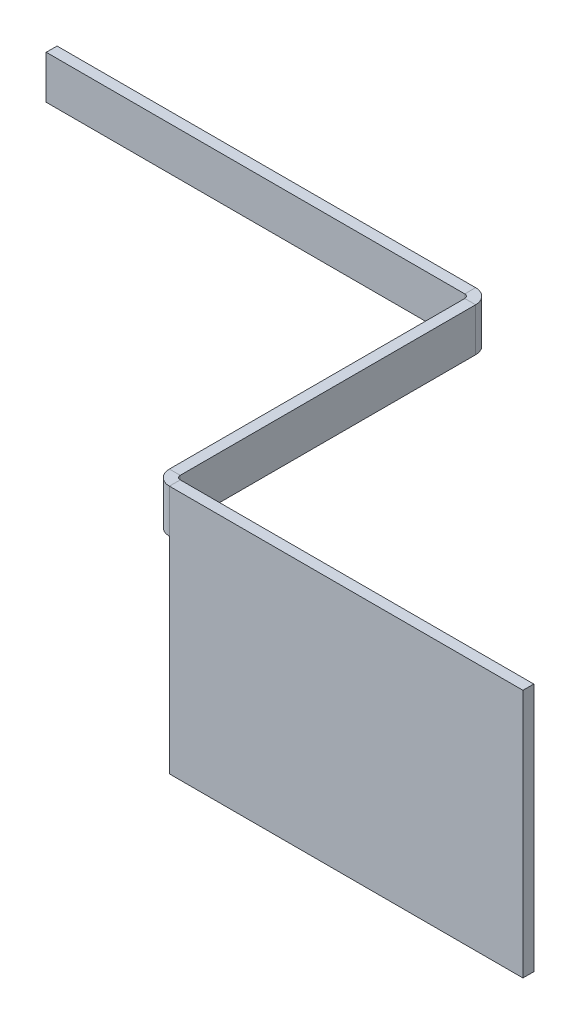
ISO-10303-21;
HEADER;
FILE_DESCRIPTION(('STEP AP214'),'2;1');
FILE_NAME('part.step','',(''),(''),'','','');
FILE_SCHEMA(('AUTOMOTIVE_DESIGN { 1 0 10303 214 1 1 1 1 }'));
ENDSEC;
DATA;
#1=APPLICATION_CONTEXT('core data for automotive mechanical design processes');
#2=APPLICATION_PROTOCOL_DEFINITION('international standard','automotive_design',2000,#1);
#3=PRODUCT_CONTEXT('',#1,'mechanical');
#4=PRODUCT('Part','Part','',(#3));
#5=PRODUCT_RELATED_PRODUCT_CATEGORY('part','',(#4));
#6=PRODUCT_DEFINITION_FORMATION('','',#4);
#7=PRODUCT_DEFINITION_CONTEXT('part definition',#1,'design');
#8=PRODUCT_DEFINITION('design','',#6,#7);
#9=PRODUCT_DEFINITION_SHAPE('','',#8);
#10=(LENGTH_UNIT() NAMED_UNIT(*) SI_UNIT(.MILLI.,.METRE.));
#11=(NAMED_UNIT(*) PLANE_ANGLE_UNIT() SI_UNIT($,.RADIAN.));
#12=(NAMED_UNIT(*) SI_UNIT($,.STERADIAN.) SOLID_ANGLE_UNIT());
#13=UNCERTAINTY_MEASURE_WITH_UNIT(LENGTH_MEASURE(1.E-05),#10,'distance_accuracy_value','');
#14=(GEOMETRIC_REPRESENTATION_CONTEXT(3) GLOBAL_UNCERTAINTY_ASSIGNED_CONTEXT((#13)) GLOBAL_UNIT_ASSIGNED_CONTEXT((#10,
#11,#12)) REPRESENTATION_CONTEXT('',''));
#15=CARTESIAN_POINT('',(0.,0.,0.));
#16=DIRECTION('',(0.,0.,1.));
#17=DIRECTION('',(1.,0.,0.));
#18=AXIS2_PLACEMENT_3D('',#15,#16,#17);
#19=CARTESIAN_POINT('',(-193.503570939661,-85.1225213772165,392.500000000001));
#20=DIRECTION('',(0.,-1.,0.));
#21=DIRECTION('',(0.,0.,-1.));
#22=AXIS2_PLACEMENT_3D('',#19,#20,#21);
#23=PLANE('',#22);
#24=DIRECTION('',(1.,0.,0.));
#25=VECTOR('',#24,1.);
#26=CARTESIAN_POINT('',(-193.503570939661,-85.1225213772165,395.236600000001));
#27=LINE('',#26,#25);
#28=CARTESIAN_POINT('',(-193.503570939661,-85.1225213772165,395.236600000001));
#29=VERTEX_POINT('',#28);
#30=CARTESIAN_POINT('',(-191.503570939661,-85.1225213772165,395.236600000001));
#31=VERTEX_POINT('',#30);
#32=EDGE_CURVE('E267',#29,#31,#27,.T.);
#33=ORIENTED_EDGE('',*,*,#32,.F.);
#34=DIRECTION('',(0.,0.,-1.));
#35=VECTOR('',#34,1.);
#36=CARTESIAN_POINT('',(-193.503570939662,-85.1225213772166,8.88178419700125E-13));
#37=LINE('',#36,#35);
#38=CARTESIAN_POINT('',(-193.503570939661,-85.1225213772165,449.763400000001));
#39=VERTEX_POINT('',#38);
#40=EDGE_CURVE('E99',#39,#29,#37,.T.);
#41=ORIENTED_EDGE('',*,*,#40,.F.);
#42=DIRECTION('',(-1.,0.,0.));
#43=VECTOR('',#42,1.);
#44=CARTESIAN_POINT('',(-191.503570939661,-85.1225213772165,449.763400000001));
#45=LINE('',#44,#43);
#46=CARTESIAN_POINT('',(-191.503570939661,-85.1225213772165,449.7634));
#47=VERTEX_POINT('',#46);
#48=EDGE_CURVE('E272',#47,#39,#45,.T.);
#49=ORIENTED_EDGE('',*,*,#48,.F.);
#50=DIRECTION('',(0.,0.,1.));
#51=VECTOR('',#50,1.);
#52=CARTESIAN_POINT('',(-191.503570939661,-85.1225213772165,392.500000000001));
#53=LINE('',#52,#51);
#54=EDGE_CURVE('E256',#47,#31,#53,.F.);
#55=ORIENTED_EDGE('',*,*,#54,.T.);
#56=EDGE_LOOP('',(#33,#41,#49,#55));
#57=FACE_BOUND('',#56,.T.);
#58=ADVANCED_FACE('F75',(#57),#23,.F.);
#59=CARTESIAN_POINT('',(-193.503570939662,0.,8.88178419700125E-13));
#60=DIRECTION('',(1.,0.,0.));
#61=DIRECTION('',(0.,0.,-1.));
#62=AXIS2_PLACEMENT_3D('',#59,#60,#61);
#63=PLANE('',#62);
#64=DIRECTION('',(0.,1.,0.));
#65=VECTOR('',#64,1.);
#66=CARTESIAN_POINT('',(-193.503570939661,-131.122521377217,395.236600000001));
#67=LINE('',#66,#65);
#68=CARTESIAN_POINT('',(-193.503570939661,-93.1225213772165,395.236600000001));
#69=VERTEX_POINT('',#68);
#70=EDGE_CURVE('E264',#69,#29,#67,.T.);
#71=ORIENTED_EDGE('',*,*,#70,.F.);
#72=DIRECTION('',(0.,0.,-1.));
#73=VECTOR('',#72,1.);
#74=CARTESIAN_POINT('',(-193.503570939661,-93.1225213772165,452.491244901112));
#75=LINE('',#74,#73);
#76=CARTESIAN_POINT('',(-193.503570939661,-93.1225213772165,449.7634));
#77=VERTEX_POINT('',#76);
#78=EDGE_CURVE('E79',#77,#69,#75,.T.);
#79=ORIENTED_EDGE('',*,*,#78,.F.);
#80=DIRECTION('',(0.,-1.,0.));
#81=VECTOR('',#80,1.);
#82=CARTESIAN_POINT('',(-193.503570939661,-131.122521377216,449.763400000001));
#83=LINE('',#82,#81);
#84=EDGE_CURVE('E84',#39,#77,#83,.T.);
#85=ORIENTED_EDGE('',*,*,#84,.F.);
#86=ORIENTED_EDGE('',*,*,#40,.T.);
#87=EDGE_LOOP('',(#71,#79,#85,#86));
#88=FACE_BOUND('',#87,.T.);
#89=ADVANCED_FACE('F280',(#88),#63,.F.);
#90=CARTESIAN_POINT('',(-191.503570939662,0.,8.88178419700125E-13));
#91=DIRECTION('',(1.,0.,0.));
#92=DIRECTION('',(0.,0.,-1.));
#93=AXIS2_PLACEMENT_3D('',#90,#91,#92);
#94=PLANE('',#93);
#95=DIRECTION('',(0.,0.,1.));
#96=VECTOR('',#95,1.);
#97=CARTESIAN_POINT('',(-191.503570939661,-93.1225213772165,452.491244901112));
#98=LINE('',#97,#96);
#99=CARTESIAN_POINT('',(-191.503570939661,-93.1225213772165,395.236600000001));
#100=VERTEX_POINT('',#99);
#101=CARTESIAN_POINT('',(-191.503570939661,-93.1225213772165,449.7634));
#102=VERTEX_POINT('',#101);
#103=EDGE_CURVE('E258',#100,#102,#98,.T.);
#104=ORIENTED_EDGE('',*,*,#103,.F.);
#105=DIRECTION('',(0.,1.,0.));
#106=VECTOR('',#105,1.);
#107=CARTESIAN_POINT('',(-191.503570939661,-131.122521377217,395.236600000001));
#108=LINE('',#107,#106);
#109=EDGE_CURVE('E255',#100,#31,#108,.T.);
#110=ORIENTED_EDGE('',*,*,#109,.T.);
#111=ORIENTED_EDGE('',*,*,#54,.F.);
#112=DIRECTION('',(0.,1.,0.));
#113=VECTOR('',#112,1.);
#114=CARTESIAN_POINT('',(-191.503570939661,-131.122521377216,449.763400000001));
#115=LINE('',#114,#113);
#116=EDGE_CURVE('E270',#102,#47,#115,.T.);
#117=ORIENTED_EDGE('',*,*,#116,.F.);
#118=EDGE_LOOP('',(#104,#110,#111,#117));
#119=FACE_BOUND('',#118,.T.);
#120=ADVANCED_FACE('F311',(#119),#94,.T.);
#121=CARTESIAN_POINT('',(-49.0941812646674,-93.1225213772165,452.491244901113));
#122=DIRECTION('',(0.,1.,0.));
#123=DIRECTION('',(0.,0.,-1.));
#124=AXIS2_PLACEMENT_3D('',#121,#122,#123);
#125=PLANE('',#124);
#126=DIRECTION('',(1.,0.,0.));
#127=VECTOR('',#126,1.);
#128=CARTESIAN_POINT('',(-193.503570939661,-93.1225213772165,449.7634));
#129=LINE('',#128,#127);
#130=EDGE_CURVE('E13',#77,#102,#129,.T.);
#131=ORIENTED_EDGE('',*,*,#130,.F.);
#132=ORIENTED_EDGE('',*,*,#78,.T.);
#133=DIRECTION('',(-1.,0.,0.));
#134=VECTOR('',#133,1.);
#135=CARTESIAN_POINT('',(-191.503570939661,-93.1225213772165,395.236600000001));
#136=LINE('',#135,#134);
#137=EDGE_CURVE('E261',#100,#69,#136,.T.);
#138=ORIENTED_EDGE('',*,*,#137,.F.);
#139=ORIENTED_EDGE('',*,*,#103,.T.);
#140=EDGE_LOOP('',(#131,#132,#138,#139));
#141=FACE_BOUND('',#140,.T.);
#142=ADVANCED_FACE('F77',(#141),#125,.F.);
#143=CARTESIAN_POINT('',(-194.240170939661,-93.1225213772165,395.236600000001));
#144=DIRECTION('',(0.,-1.,0.));
#145=DIRECTION('',(1.,0.,0.));
#146=AXIS2_PLACEMENT_3D('',#143,#144,#145);
#147=PLANE('',#146);
#148=ORIENTED_EDGE('',*,*,#137,.T.);
#149=CARTESIAN_POINT('',(-194.240170939661,-93.1225213772165,395.236600000001));
#150=DIRECTION('',(0.,1.,0.));
#151=DIRECTION('',(-1.,0.,0.));
#152=AXIS2_PLACEMENT_3D('',#149,#150,#151);
#153=CIRCLE('',#152,0.7366);
#154=CARTESIAN_POINT('',(-194.240170939661,-93.1225213772165,394.500000000001));
#155=VERTEX_POINT('',#154);
#156=EDGE_CURVE('E214',#69,#155,#153,.T.);
#157=ORIENTED_EDGE('',*,*,#156,.T.);
#158=DIRECTION('',(0.,0.,-1.));
#159=VECTOR('',#158,1.);
#160=CARTESIAN_POINT('',(-194.240170939661,-93.1225213772165,394.500000000001));
#161=LINE('',#160,#159);
#162=CARTESIAN_POINT('',(-194.240170939661,-93.1225213772165,392.5));
#163=VERTEX_POINT('',#162);
#164=EDGE_CURVE('E234',#155,#163,#161,.T.);
#165=ORIENTED_EDGE('',*,*,#164,.T.);
#166=CARTESIAN_POINT('',(-194.240170939661,-93.1225213772165,395.236600000001));
#167=DIRECTION('',(0.,1.,0.));
#168=DIRECTION('',(1.,0.,0.));
#169=AXIS2_PLACEMENT_3D('',#166,#167,#168);
#170=CIRCLE('',#169,2.73659999999999);
#171=EDGE_CURVE('E243',#100,#163,#170,.T.);
#172=ORIENTED_EDGE('',*,*,#171,.F.);
#173=EDGE_LOOP('',(#148,#157,#165,#172));
#174=FACE_BOUND('',#173,.T.);
#175=ADVANCED_FACE('F285',(#174),#147,.T.);
#176=CARTESIAN_POINT('',(-194.240170939661,-85.1225213772165,395.236600000001));
#177=DIRECTION('',(0.,1.,0.));
#178=DIRECTION('',(-1.,0.,0.));
#179=AXIS2_PLACEMENT_3D('',#176,#177,#178);
#180=PLANE('',#179);
#181=DIRECTION('',(0.,0.,-1.));
#182=VECTOR('',#181,1.);
#183=CARTESIAN_POINT('',(-194.240170939661,-85.1225213772165,392.500000000001));
#184=LINE('',#183,#182);
#185=CARTESIAN_POINT('',(-194.240170939661,-85.1225213772165,394.500000000001));
#186=VERTEX_POINT('',#185);
#187=CARTESIAN_POINT('',(-194.240170939661,-85.1225213772165,392.500000000001));
#188=VERTEX_POINT('',#187);
#189=EDGE_CURVE('E218',#186,#188,#184,.T.);
#190=ORIENTED_EDGE('',*,*,#189,.F.);
#191=CARTESIAN_POINT('',(-194.240170939661,-85.1225213772165,395.236600000001));
#192=DIRECTION('',(0.,1.,0.));
#193=DIRECTION('',(-1.,0.,0.));
#194=AXIS2_PLACEMENT_3D('',#191,#192,#193);
#195=CIRCLE('',#194,0.7366);
#196=EDGE_CURVE('E247',#186,#29,#195,.F.);
#197=ORIENTED_EDGE('',*,*,#196,.T.);
#198=ORIENTED_EDGE('',*,*,#32,.T.);
#199=CARTESIAN_POINT('',(-194.240170939661,-85.1225213772165,395.236600000001));
#200=DIRECTION('',(0.,-1.,0.));
#201=DIRECTION('',(1.,0.,0.));
#202=AXIS2_PLACEMENT_3D('',#199,#200,#201);
#203=CIRCLE('',#202,2.73659999999999);
#204=EDGE_CURVE('E246',#188,#31,#203,.T.);
#205=ORIENTED_EDGE('',*,*,#204,.F.);
#206=EDGE_LOOP('',(#190,#197,#198,#205));
#207=FACE_BOUND('',#206,.T.);
#208=ADVANCED_FACE('F297',(#207),#180,.T.);
#209=CARTESIAN_POINT('',(-194.240170939661,-97.8082071765373,395.236600000001));
#210=DIRECTION('',(0.,1.,0.));
#211=DIRECTION('',(-1.,0.,0.));
#212=AXIS2_PLACEMENT_3D('',#209,#210,#211);
#213=CYLINDRICAL_SURFACE('',#212,2.7366);
#214=ORIENTED_EDGE('',*,*,#204,.T.);
#215=ORIENTED_EDGE('',*,*,#109,.F.);
#216=ORIENTED_EDGE('',*,*,#171,.T.);
#217=DIRECTION('',(0.,1.,0.));
#218=VECTOR('',#217,1.);
#219=CARTESIAN_POINT('',(-194.240170939661,-85.1225213772165,392.500000000001));
#220=LINE('',#219,#218);
#221=EDGE_CURVE('E240',#163,#188,#220,.T.);
#222=ORIENTED_EDGE('',*,*,#221,.T.);
#223=EDGE_LOOP('',(#214,#215,#216,#222));
#224=FACE_BOUND('',#223,.T.);
#225=ADVANCED_FACE('F308',(#224),#213,.T.);
#226=CARTESIAN_POINT('',(-194.240170939661,-97.8082071765373,395.236600000001));
#227=DIRECTION('',(0.,1.,0.));
#228=DIRECTION('',(-1.,0.,0.));
#229=AXIS2_PLACEMENT_3D('',#226,#227,#228);
#230=CYLINDRICAL_SURFACE('',#229,0.7366);
#231=ORIENTED_EDGE('',*,*,#196,.F.);
#232=DIRECTION('',(0.,-1.,0.));
#233=VECTOR('',#232,1.);
#234=CARTESIAN_POINT('',(-194.240170939661,-85.1225213772165,394.500000000001));
#235=LINE('',#234,#233);
#236=EDGE_CURVE('E237',#186,#155,#235,.T.);
#237=ORIENTED_EDGE('',*,*,#236,.T.);
#238=ORIENTED_EDGE('',*,*,#156,.F.);
#239=ORIENTED_EDGE('',*,*,#70,.T.);
#240=EDGE_LOOP('',(#231,#237,#238,#239));
#241=FACE_BOUND('',#240,.T.);
#242=ADVANCED_FACE('F287',(#241),#230,.F.);
#243=CARTESIAN_POINT('',(-271.503570939661,-85.1225213772165,392.500000000001));
#244=DIRECTION('',(1.,0.,0.));
#245=DIRECTION('',(0.,0.,-1.));
#246=AXIS2_PLACEMENT_3D('',#243,#244,#245);
#247=PLANE('',#246);
#248=DIRECTION('',(0.,1.,0.));
#249=VECTOR('',#248,1.);
#250=CARTESIAN_POINT('',(-271.503570939661,0.,392.500000000001));
#251=LINE('',#250,#249);
#252=CARTESIAN_POINT('',(-271.503570939661,-93.1225213772165,392.500000000001));
#253=VERTEX_POINT('',#252);
#254=CARTESIAN_POINT('',(-271.503570939661,-85.1225213772165,392.500000000001));
#255=VERTEX_POINT('',#254);
#256=EDGE_CURVE('E227',#253,#255,#251,.T.);
#257=ORIENTED_EDGE('',*,*,#256,.F.);
#258=DIRECTION('',(0.,0.,1.));
#259=VECTOR('',#258,1.);
#260=CARTESIAN_POINT('',(-271.503570939661,-93.1225213772165,250.090610325007));
#261=LINE('',#260,#259);
#262=CARTESIAN_POINT('',(-271.503570939661,-93.1225213772165,394.500000000001));
#263=VERTEX_POINT('',#262);
#264=EDGE_CURVE('E231',#253,#263,#261,.T.);
#265=ORIENTED_EDGE('',*,*,#264,.T.);
#266=DIRECTION('',(0.,-1.,0.));
#267=VECTOR('',#266,1.);
#268=CARTESIAN_POINT('',(-271.503570939661,-85.1225213772165,394.500000000001));
#269=LINE('',#268,#267);
#270=CARTESIAN_POINT('',(-271.503570939661,-85.1225213772165,394.500000000001));
#271=VERTEX_POINT('',#270);
#272=EDGE_CURVE('E229',#263,#271,#269,.F.);
#273=ORIENTED_EDGE('',*,*,#272,.T.);
#274=DIRECTION('',(0.,0.,1.));
#275=VECTOR('',#274,1.);
#276=CARTESIAN_POINT('',(-271.503570939661,-85.1225213772165,392.500000000001));
#277=LINE('',#276,#275);
#278=EDGE_CURVE('E215',#255,#271,#277,.T.);
#279=ORIENTED_EDGE('',*,*,#278,.F.);
#280=EDGE_LOOP('',(#257,#265,#273,#279));
#281=FACE_BOUND('',#280,.T.);
#282=ADVANCED_FACE('F378',(#281),#247,.F.);
#283=CARTESIAN_POINT('',(0.,0.,392.500000000001));
#284=DIRECTION('',(0.,0.,1.));
#285=DIRECTION('',(1.,0.,0.));
#286=AXIS2_PLACEMENT_3D('',#283,#284,#285);
#287=PLANE('',#286);
#288=ORIENTED_EDGE('',*,*,#221,.F.);
#289=DIRECTION('',(1.,0.,0.));
#290=VECTOR('',#289,1.);
#291=CARTESIAN_POINT('',(-134.257681137437,-93.1225213772165,392.5));
#292=LINE('',#291,#290);
#293=EDGE_CURVE('E220',#253,#163,#292,.T.);
#294=ORIENTED_EDGE('',*,*,#293,.F.);
#295=ORIENTED_EDGE('',*,*,#256,.T.);
#296=DIRECTION('',(1.,0.,0.));
#297=VECTOR('',#296,1.);
#298=CARTESIAN_POINT('',(0.,-85.1225213772165,392.500000000001));
#299=LINE('',#298,#297);
#300=EDGE_CURVE('E224',#255,#188,#299,.T.);
#301=ORIENTED_EDGE('',*,*,#300,.T.);
#302=EDGE_LOOP('',(#288,#294,#295,#301));
#303=FACE_BOUND('',#302,.T.);
#304=ADVANCED_FACE('F303',(#303),#287,.F.);
#305=CARTESIAN_POINT('',(-134.257681137437,-93.1225213772165,250.090610325007));
#306=DIRECTION('',(0.,1.,0.));
#307=DIRECTION('',(-1.,0.,0.));
#308=AXIS2_PLACEMENT_3D('',#305,#306,#307);
#309=PLANE('',#308);
#310=ORIENTED_EDGE('',*,*,#164,.F.);
#311=DIRECTION('',(-1.,0.,0.));
#312=VECTOR('',#311,1.);
#313=CARTESIAN_POINT('',(-134.257681137437,-93.1225213772165,394.500000000001));
#314=LINE('',#313,#312);
#315=EDGE_CURVE('E222',#155,#263,#314,.T.);
#316=ORIENTED_EDGE('',*,*,#315,.T.);
#317=ORIENTED_EDGE('',*,*,#264,.F.);
#318=ORIENTED_EDGE('',*,*,#293,.T.);
#319=EDGE_LOOP('',(#310,#316,#317,#318));
#320=FACE_BOUND('',#319,.T.);
#321=ADVANCED_FACE('F385',(#320),#309,.F.);
#322=CARTESIAN_POINT('',(0.,0.,394.500000000001));
#323=DIRECTION('',(0.,0.,1.));
#324=DIRECTION('',(1.,0.,0.));
#325=AXIS2_PLACEMENT_3D('',#322,#323,#324);
#326=PLANE('',#325);
#327=ORIENTED_EDGE('',*,*,#315,.F.);
#328=ORIENTED_EDGE('',*,*,#236,.F.);
#329=DIRECTION('',(-1.,0.,0.));
#330=VECTOR('',#329,1.);
#331=CARTESIAN_POINT('',(-193.503570939661,-85.1225213772165,394.500000000001));
#332=LINE('',#331,#330);
#333=EDGE_CURVE('E212',#271,#186,#332,.F.);
#334=ORIENTED_EDGE('',*,*,#333,.F.);
#335=ORIENTED_EDGE('',*,*,#272,.F.);
#336=EDGE_LOOP('',(#327,#328,#334,#335));
#337=FACE_BOUND('',#336,.T.);
#338=ADVANCED_FACE('F292',(#337),#326,.T.);
#339=CARTESIAN_POINT('',(-193.503570939661,-85.1225213772165,392.500000000001));
#340=DIRECTION('',(0.,-1.,0.));
#341=DIRECTION('',(0.,0.,-1.));
#342=AXIS2_PLACEMENT_3D('',#339,#340,#341);
#343=PLANE('',#342);
#344=ORIENTED_EDGE('',*,*,#189,.T.);
#345=ORIENTED_EDGE('',*,*,#300,.F.);
#346=ORIENTED_EDGE('',*,*,#278,.T.);
#347=ORIENTED_EDGE('',*,*,#333,.T.);
#348=EDGE_LOOP('',(#344,#345,#346,#347));
#349=FACE_BOUND('',#348,.T.);
#350=ADVANCED_FACE('F300',(#349),#343,.F.);
#351=CARTESIAN_POINT('',(-125.503570939661,-131.122521377216,450.5));
#352=DIRECTION('',(0.,-1.,0.));
#353=DIRECTION('',(1.,0.,0.));
#354=AXIS2_PLACEMENT_3D('',#351,#352,#353);
#355=PLANE('',#354);
#356=DIRECTION('',(0.,0.,1.));
#357=VECTOR('',#356,1.);
#358=CARTESIAN_POINT('',(-190.766970939661,-131.122521377216,450.5));
#359=LINE('',#358,#357);
#360=CARTESIAN_POINT('',(-190.766970939661,-131.122521377216,450.500000000001));
#361=VERTEX_POINT('',#360);
#362=CARTESIAN_POINT('',(-190.766970939661,-131.122521377216,452.500000000001));
#363=VERTEX_POINT('',#362);
#364=EDGE_CURVE('E199',#361,#363,#359,.T.);
#365=ORIENTED_EDGE('',*,*,#364,.F.);
#366=DIRECTION('',(1.,0.,0.));
#367=VECTOR('',#366,1.);
#368=CARTESIAN_POINT('',(-125.503570939661,-131.122521377216,450.5));
#369=LINE('',#368,#367);
#370=CARTESIAN_POINT('',(-125.503570939661,-131.122521377216,450.5));
#371=VERTEX_POINT('',#370);
#372=EDGE_CURVE('E196',#361,#371,#369,.T.);
#373=ORIENTED_EDGE('',*,*,#372,.T.);
#374=DIRECTION('',(0.,0.,1.));
#375=VECTOR('',#374,1.);
#376=CARTESIAN_POINT('',(-125.503570939661,-131.122521377216,450.5));
#377=LINE('',#376,#375);
#378=CARTESIAN_POINT('',(-125.503570939661,-131.122521377216,452.5));
#379=VERTEX_POINT('',#378);
#380=EDGE_CURVE('E208',#371,#379,#377,.T.);
#381=ORIENTED_EDGE('',*,*,#380,.T.);
#382=DIRECTION('',(1.,0.,0.));
#383=VECTOR('',#382,1.);
#384=CARTESIAN_POINT('',(-125.503570939661,-131.122521377216,452.5));
#385=LINE('',#384,#383);
#386=EDGE_CURVE('E329',#363,#379,#385,.T.);
#387=ORIENTED_EDGE('',*,*,#386,.F.);
#388=EDGE_LOOP('',(#365,#373,#381,#387));
#389=FACE_BOUND('',#388,.T.);
#390=ADVANCED_FACE('F348',(#389),#355,.T.);
#391=CARTESIAN_POINT('',(-125.503570939661,-131.122521377216,450.5));
#392=DIRECTION('',(1.,0.,0.));
#393=DIRECTION('',(0.,0.,-1.));
#394=AXIS2_PLACEMENT_3D('',#391,#392,#393);
#395=PLANE('',#394);
#396=DIRECTION('',(0.,1.,0.));
#397=VECTOR('',#396,1.);
#398=CARTESIAN_POINT('',(-125.503570939661,-131.122521377216,452.5));
#399=LINE('',#398,#397);
#400=CARTESIAN_POINT('',(-125.503570939661,-85.1225213772165,452.5));
#401=VERTEX_POINT('',#400);
#402=EDGE_CURVE('E200',#379,#401,#399,.T.);
#403=ORIENTED_EDGE('',*,*,#402,.F.);
#404=ORIENTED_EDGE('',*,*,#380,.F.);
#405=DIRECTION('',(0.,1.,0.));
#406=VECTOR('',#405,1.);
#407=CARTESIAN_POINT('',(-125.503570939661,-131.122521377216,450.5));
#408=LINE('',#407,#406);
#409=CARTESIAN_POINT('',(-125.503570939661,-85.1225213772165,450.5));
#410=VERTEX_POINT('',#409);
#411=EDGE_CURVE('E341',#371,#410,#408,.T.);
#412=ORIENTED_EDGE('',*,*,#411,.T.);
#413=DIRECTION('',(0.,0.,1.));
#414=VECTOR('',#413,1.);
#415=CARTESIAN_POINT('',(-125.503570939661,-85.1225213772165,450.5));
#416=LINE('',#415,#414);
#417=EDGE_CURVE('E339',#410,#401,#416,.T.);
#418=ORIENTED_EDGE('',*,*,#417,.T.);
#419=EDGE_LOOP('',(#403,#404,#412,#418));
#420=FACE_BOUND('',#419,.T.);
#421=ADVANCED_FACE('F350',(#420),#395,.T.);
#422=CARTESIAN_POINT('',(0.,0.,450.5));
#423=DIRECTION('',(0.,0.,1.));
#424=DIRECTION('',(1.,0.,0.));
#425=AXIS2_PLACEMENT_3D('',#422,#423,#424);
#426=PLANE('',#425);
#427=DIRECTION('',(0.,-1.,0.));
#428=VECTOR('',#427,1.);
#429=CARTESIAN_POINT('',(-190.766970939661,-85.1225213772165,450.5));
#430=LINE('',#429,#428);
#431=CARTESIAN_POINT('',(-190.766970939661,-85.1225213772165,450.5));
#432=VERTEX_POINT('',#431);
#433=CARTESIAN_POINT('',(-190.766970939661,-93.1225213772165,450.5));
#434=VERTEX_POINT('',#433);
#435=EDGE_CURVE('E184',#432,#434,#430,.T.);
#436=ORIENTED_EDGE('',*,*,#435,.F.);
#437=DIRECTION('',(-1.,0.,0.));
#438=VECTOR('',#437,1.);
#439=CARTESIAN_POINT('',(-125.503570939661,-85.1225213772165,450.5));
#440=LINE('',#439,#438);
#441=EDGE_CURVE('E337',#410,#432,#440,.T.);
#442=ORIENTED_EDGE('',*,*,#441,.F.);
#443=ORIENTED_EDGE('',*,*,#411,.F.);
#444=ORIENTED_EDGE('',*,*,#372,.F.);
#445=DIRECTION('',(0.,-1.,0.));
#446=VECTOR('',#445,1.);
#447=CARTESIAN_POINT('',(-190.766970939661,-131.122521377216,450.500000000001));
#448=LINE('',#447,#446);
#449=EDGE_CURVE('E193',#434,#361,#448,.T.);
#450=ORIENTED_EDGE('',*,*,#449,.F.);
#451=EDGE_LOOP('',(#436,#442,#443,#444,#450));
#452=FACE_BOUND('',#451,.T.);
#453=ADVANCED_FACE('F194',(#452),#426,.F.);
#454=CARTESIAN_POINT('',(-125.503570939661,-85.1225213772165,450.5));
#455=DIRECTION('',(0.,1.,0.));
#456=DIRECTION('',(0.,0.,1.));
#457=AXIS2_PLACEMENT_3D('',#454,#455,#456);
#458=PLANE('',#457);
#459=ORIENTED_EDGE('',*,*,#441,.T.);
#460=DIRECTION('',(0.,0.,1.));
#461=VECTOR('',#460,1.);
#462=CARTESIAN_POINT('',(-190.766970939661,-85.1225213772165,450.5));
#463=LINE('',#462,#461);
#464=CARTESIAN_POINT('',(-190.766970939661,-85.1225213772165,452.5));
#465=VERTEX_POINT('',#464);
#466=EDGE_CURVE('E334',#432,#465,#463,.T.);
#467=ORIENTED_EDGE('',*,*,#466,.T.);
#468=DIRECTION('',(-1.,0.,0.));
#469=VECTOR('',#468,1.);
#470=CARTESIAN_POINT('',(-125.503570939661,-85.1225213772165,452.5));
#471=LINE('',#470,#469);
#472=EDGE_CURVE('E332',#401,#465,#471,.T.);
#473=ORIENTED_EDGE('',*,*,#472,.F.);
#474=ORIENTED_EDGE('',*,*,#417,.F.);
#475=EDGE_LOOP('',(#459,#467,#473,#474));
#476=FACE_BOUND('',#475,.T.);
#477=ADVANCED_FACE('F355',(#476),#458,.T.);
#478=CARTESIAN_POINT('',(0.,0.,452.5));
#479=DIRECTION('',(0.,0.,1.));
#480=DIRECTION('',(1.,0.,0.));
#481=AXIS2_PLACEMENT_3D('',#478,#479,#480);
#482=PLANE('',#481);
#483=ORIENTED_EDGE('',*,*,#472,.T.);
#484=DIRECTION('',(0.,-1.,0.));
#485=VECTOR('',#484,1.);
#486=CARTESIAN_POINT('',(-190.766970939661,-85.1225213772165,452.5));
#487=LINE('',#486,#485);
#488=CARTESIAN_POINT('',(-190.766970939661,-93.1225213772165,452.5));
#489=VERTEX_POINT('',#488);
#490=EDGE_CURVE('E319',#465,#489,#487,.T.);
#491=ORIENTED_EDGE('',*,*,#490,.T.);
#492=DIRECTION('',(0.,1.,0.));
#493=VECTOR('',#492,1.);
#494=CARTESIAN_POINT('',(-190.766970939661,-131.122521377216,452.500000000001));
#495=LINE('',#494,#493);
#496=EDGE_CURVE('E205',#363,#489,#495,.T.);
#497=ORIENTED_EDGE('',*,*,#496,.F.);
#498=ORIENTED_EDGE('',*,*,#386,.T.);
#499=ORIENTED_EDGE('',*,*,#402,.T.);
#500=EDGE_LOOP('',(#483,#491,#497,#498,#499));
#501=FACE_BOUND('',#500,.T.);
#502=ADVANCED_FACE('F353',(#501),#482,.T.);
#503=CARTESIAN_POINT('',(-190.766970939661,-131.122521377216,308.090610325007));
#504=DIRECTION('',(1.,0.,0.));
#505=DIRECTION('',(0.,0.,-1.));
#506=AXIS2_PLACEMENT_3D('',#503,#504,#505);
#507=PLANE('',#506);
#508=ORIENTED_EDGE('',*,*,#449,.T.);
#509=ORIENTED_EDGE('',*,*,#364,.T.);
#510=ORIENTED_EDGE('',*,*,#496,.T.);
#511=DIRECTION('',(0.,0.,1.));
#512=VECTOR('',#511,1.);
#513=CARTESIAN_POINT('',(-190.766970939661,-93.1225213772165,308.090610325007));
#514=LINE('',#513,#512);
#515=EDGE_CURVE('E175',#434,#489,#514,.T.);
#516=ORIENTED_EDGE('',*,*,#515,.F.);
#517=EDGE_LOOP('',(#508,#509,#510,#516));
#518=FACE_BOUND('',#517,.T.);
#519=ADVANCED_FACE('F203',(#518),#507,.F.);
#520=CARTESIAN_POINT('',(-190.766970939661,-93.1225213772165,449.7634));
#521=DIRECTION('',(0.,1.,0.));
#522=DIRECTION('',(0.,0.,1.));
#523=AXIS2_PLACEMENT_3D('',#520,#521,#522);
#524=PLANE('',#523);
#525=ORIENTED_EDGE('',*,*,#515,.T.);
#526=CARTESIAN_POINT('',(-190.766970939661,-93.1225213772165,449.7634));
#527=DIRECTION('',(0.,1.,0.));
#528=DIRECTION('',(0.,0.,1.));
#529=AXIS2_PLACEMENT_3D('',#526,#527,#528);
#530=CIRCLE('',#529,2.7366);
#531=EDGE_CURVE('E320',#489,#77,#530,.F.);
#532=ORIENTED_EDGE('',*,*,#531,.T.);
#533=ORIENTED_EDGE('',*,*,#130,.T.);
#534=CARTESIAN_POINT('',(-190.766970939661,-93.1225213772165,449.7634));
#535=DIRECTION('',(0.,-1.,0.));
#536=DIRECTION('',(0.,0.,1.));
#537=AXIS2_PLACEMENT_3D('',#534,#535,#536);
#538=CIRCLE('',#537,0.73659999999999);
#539=EDGE_CURVE('E170',#434,#102,#538,.T.);
#540=ORIENTED_EDGE('',*,*,#539,.F.);
#541=EDGE_LOOP('',(#525,#532,#533,#540));
#542=FACE_BOUND('',#541,.T.);
#543=ADVANCED_FACE('F172',(#542),#524,.F.);
#544=CARTESIAN_POINT('',(-190.766970939661,-85.1225213772165,449.7634));
#545=DIRECTION('',(0.,-1.,0.));
#546=DIRECTION('',(0.,0.,-1.));
#547=AXIS2_PLACEMENT_3D('',#544,#545,#546);
#548=PLANE('',#547);
#549=ORIENTED_EDGE('',*,*,#48,.T.);
#550=CARTESIAN_POINT('',(-190.766970939661,-85.1225213772165,449.7634));
#551=DIRECTION('',(0.,1.,0.));
#552=DIRECTION('',(0.,0.,1.));
#553=AXIS2_PLACEMENT_3D('',#550,#551,#552);
#554=CIRCLE('',#553,2.7366);
#555=EDGE_CURVE('E180',#39,#465,#554,.T.);
#556=ORIENTED_EDGE('',*,*,#555,.T.);
#557=ORIENTED_EDGE('',*,*,#466,.F.);
#558=CARTESIAN_POINT('',(-190.766970939661,-85.1225213772165,449.7634));
#559=DIRECTION('',(0.,1.,0.));
#560=DIRECTION('',(0.,0.,1.));
#561=AXIS2_PLACEMENT_3D('',#558,#559,#560);
#562=CIRCLE('',#561,0.73659999999999);
#563=EDGE_CURVE('E179',#47,#432,#562,.T.);
#564=ORIENTED_EDGE('',*,*,#563,.F.);
#565=EDGE_LOOP('',(#549,#556,#557,#564));
#566=FACE_BOUND('',#565,.T.);
#567=ADVANCED_FACE('F315',(#566),#548,.F.);
#568=CARTESIAN_POINT('',(-190.766970939661,-97.8082071765374,449.7634));
#569=DIRECTION('',(0.,1.,0.));
#570=DIRECTION('',(0.,0.,1.));
#571=AXIS2_PLACEMENT_3D('',#568,#569,#570);
#572=CYLINDRICAL_SURFACE('',#571,0.7366);
#573=ORIENTED_EDGE('',*,*,#563,.T.);
#574=ORIENTED_EDGE('',*,*,#435,.T.);
#575=ORIENTED_EDGE('',*,*,#539,.T.);
#576=ORIENTED_EDGE('',*,*,#116,.T.);
#577=EDGE_LOOP('',(#573,#574,#575,#576));
#578=FACE_BOUND('',#577,.T.);
#579=ADVANCED_FACE('F186',(#578),#572,.F.);
#580=CARTESIAN_POINT('',(-190.766970939661,-97.8082071765374,449.7634));
#581=DIRECTION('',(0.,1.,0.));
#582=DIRECTION('',(0.,0.,1.));
#583=AXIS2_PLACEMENT_3D('',#580,#581,#582);
#584=CYLINDRICAL_SURFACE('',#583,2.7366);
#585=ORIENTED_EDGE('',*,*,#555,.F.);
#586=ORIENTED_EDGE('',*,*,#84,.T.);
#587=ORIENTED_EDGE('',*,*,#531,.F.);
#588=ORIENTED_EDGE('',*,*,#490,.F.);
#589=EDGE_LOOP('',(#585,#586,#587,#588));
#590=FACE_BOUND('',#589,.T.);
#591=ADVANCED_FACE('F318',(#590),#584,.T.);
#592=CLOSED_SHELL('',(#58,#89,#120,#142,#175,#208,#225,#242,#282,#304,#321,#338,#350,#390,#421,
#453,#477,#502,#519,#543,#567,#579,#591));
#593=MANIFOLD_SOLID_BREP('B2',#592);
#594=ADVANCED_BREP_SHAPE_REPRESENTATION('',(#18,#593),#14);
#595=SHAPE_DEFINITION_REPRESENTATION(#9,#594);
ENDSEC;
END-ISO-10303-21;
